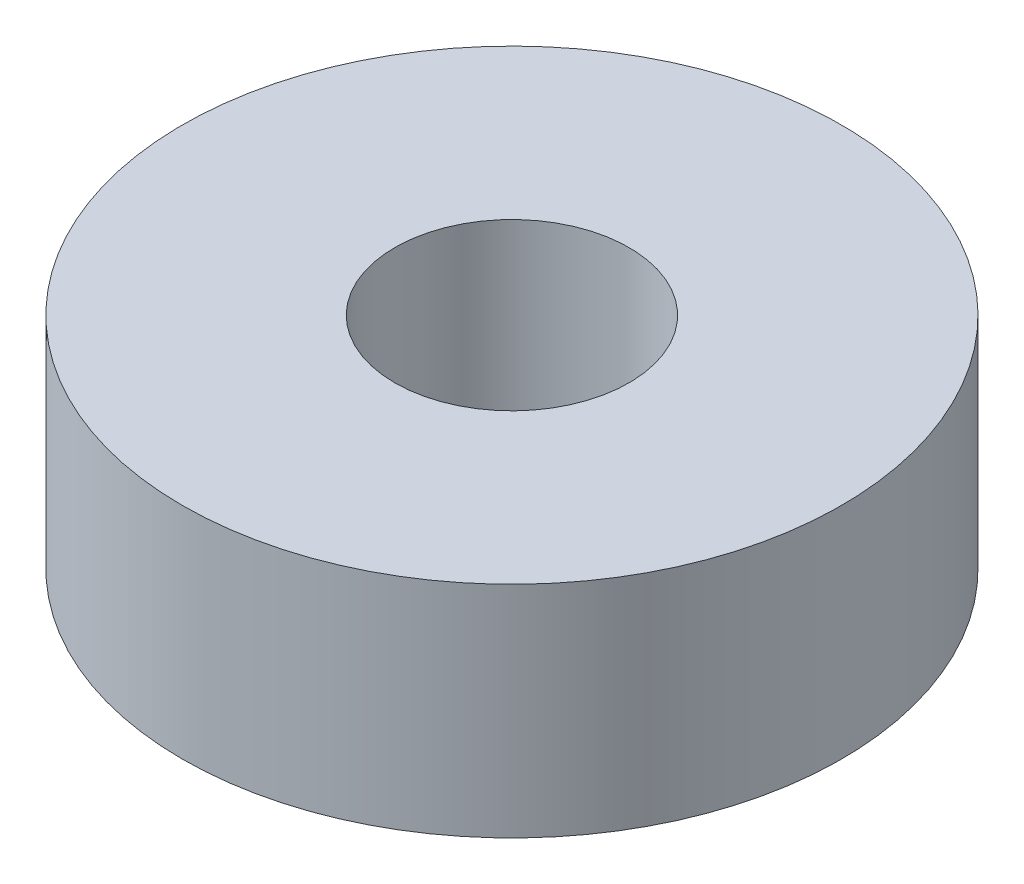
ISO-10303-21;
HEADER;
FILE_DESCRIPTION(('STEP AP214'),'2;1');
FILE_NAME('part.step','',(''),(''),'','','');
FILE_SCHEMA(('AUTOMOTIVE_DESIGN { 1 0 10303 214 1 1 1 1 }'));
ENDSEC;
DATA;
#1=APPLICATION_CONTEXT('core data for automotive mechanical design processes');
#2=APPLICATION_PROTOCOL_DEFINITION('international standard','automotive_design',2000,#1);
#3=PRODUCT_CONTEXT('',#1,'mechanical');
#4=PRODUCT('Part','Part','',(#3));
#5=PRODUCT_RELATED_PRODUCT_CATEGORY('part','',(#4));
#6=PRODUCT_DEFINITION_FORMATION('','',#4);
#7=PRODUCT_DEFINITION_CONTEXT('part definition',#1,'design');
#8=PRODUCT_DEFINITION('design','',#6,#7);
#9=PRODUCT_DEFINITION_SHAPE('','',#8);
#10=(LENGTH_UNIT() NAMED_UNIT(*) SI_UNIT(.MILLI.,.METRE.));
#11=(NAMED_UNIT(*) PLANE_ANGLE_UNIT() SI_UNIT($,.RADIAN.));
#12=(NAMED_UNIT(*) SI_UNIT($,.STERADIAN.) SOLID_ANGLE_UNIT());
#13=UNCERTAINTY_MEASURE_WITH_UNIT(LENGTH_MEASURE(1.E-05),#10,'distance_accuracy_value','');
#14=(GEOMETRIC_REPRESENTATION_CONTEXT(3) GLOBAL_UNCERTAINTY_ASSIGNED_CONTEXT((#13)) GLOBAL_UNIT_ASSIGNED_CONTEXT((#10,
#11,#12)) REPRESENTATION_CONTEXT('',''));
#15=CARTESIAN_POINT('',(0.,0.,0.));
#16=DIRECTION('',(0.,0.,1.));
#17=DIRECTION('',(1.,0.,0.));
#18=AXIS2_PLACEMENT_3D('',#15,#16,#17);
#19=CARTESIAN_POINT('',(0.,15.,0.));
#20=DIRECTION('',(0.,1.,0.));
#21=DIRECTION('',(0.,0.,1.));
#22=AXIS2_PLACEMENT_3D('',#19,#20,#21);
#23=PLANE('',#22);
#24=CARTESIAN_POINT('',(0.,15.,0.));
#25=DIRECTION('',(0.,1.,0.));
#26=DIRECTION('',(0.,0.,1.));
#27=AXIS2_PLACEMENT_3D('',#24,#25,#26);
#28=CIRCLE('',#27,22.5);
#29=CARTESIAN_POINT('',(0.,15.,22.5));
#30=VERTEX_POINT('',#29);
#31=EDGE_CURVE('E10',#30,#30,#28,.T.);
#32=ORIENTED_EDGE('',*,*,#31,.T.);
#33=EDGE_LOOP('',(#32));
#34=FACE_BOUND('',#33,.T.);
#35=CARTESIAN_POINT('',(0.,15.,0.));
#36=DIRECTION('',(0.,1.,0.));
#37=DIRECTION('',(0.,0.,1.));
#38=AXIS2_PLACEMENT_3D('',#35,#36,#37);
#39=CIRCLE('',#38,8.);
#40=CARTESIAN_POINT('',(0.,15.,8.));
#41=VERTEX_POINT('',#40);
#42=EDGE_CURVE('E44',#41,#41,#39,.T.);
#43=ORIENTED_EDGE('',*,*,#42,.F.);
#44=EDGE_LOOP('',(#43));
#45=FACE_BOUND('',#44,.T.);
#46=ADVANCED_FACE('F33',(#34,#45),#23,.T.);
#47=CARTESIAN_POINT('',(0.,0.,0.));
#48=DIRECTION('',(0.,1.,0.));
#49=DIRECTION('',(0.,0.,1.));
#50=AXIS2_PLACEMENT_3D('',#47,#48,#49);
#51=PLANE('',#50);
#52=CARTESIAN_POINT('',(0.,0.,0.));
#53=DIRECTION('',(0.,1.,0.));
#54=DIRECTION('',(0.,0.,1.));
#55=AXIS2_PLACEMENT_3D('',#52,#53,#54);
#56=CIRCLE('',#55,22.5);
#57=CARTESIAN_POINT('',(0.,0.,22.5));
#58=VERTEX_POINT('',#57);
#59=EDGE_CURVE('E37',#58,#58,#56,.T.);
#60=ORIENTED_EDGE('',*,*,#59,.F.);
#61=EDGE_LOOP('',(#60));
#62=FACE_BOUND('',#61,.T.);
#63=CARTESIAN_POINT('',(0.,0.,0.));
#64=DIRECTION('',(0.,1.,0.));
#65=DIRECTION('',(0.,0.,1.));
#66=AXIS2_PLACEMENT_3D('',#63,#64,#65);
#67=CIRCLE('',#66,8.);
#68=CARTESIAN_POINT('',(0.,0.,8.));
#69=VERTEX_POINT('',#68);
#70=EDGE_CURVE('E46',#69,#69,#67,.T.);
#71=ORIENTED_EDGE('',*,*,#70,.T.);
#72=EDGE_LOOP('',(#71));
#73=FACE_BOUND('',#72,.T.);
#74=ADVANCED_FACE('F56',(#62,#73),#51,.F.);
#75=CARTESIAN_POINT('',(0.,15.,0.));
#76=DIRECTION('',(0.,-1.,0.));
#77=DIRECTION('',(0.,0.,-1.));
#78=AXIS2_PLACEMENT_3D('',#75,#76,#77);
#79=CYLINDRICAL_SURFACE('',#78,22.5);
#80=ORIENTED_EDGE('',*,*,#31,.F.);
#81=EDGE_LOOP('',(#80));
#82=FACE_BOUND('',#81,.T.);
#83=ORIENTED_EDGE('',*,*,#59,.T.);
#84=EDGE_LOOP('',(#83));
#85=FACE_BOUND('',#84,.T.);
#86=ADVANCED_FACE('F35',(#82,#85),#79,.T.);
#87=CARTESIAN_POINT('',(0.,15.,0.));
#88=DIRECTION('',(0.,-1.,0.));
#89=DIRECTION('',(0.,0.,-1.));
#90=AXIS2_PLACEMENT_3D('',#87,#88,#89);
#91=CYLINDRICAL_SURFACE('',#90,8.);
#92=ORIENTED_EDGE('',*,*,#42,.T.);
#93=EDGE_LOOP('',(#92));
#94=FACE_BOUND('',#93,.T.);
#95=ORIENTED_EDGE('',*,*,#70,.F.);
#96=EDGE_LOOP('',(#95));
#97=FACE_BOUND('',#96,.T.);
#98=ADVANCED_FACE('F52',(#94,#97),#91,.F.);
#99=CLOSED_SHELL('',(#46,#74,#86,#98));
#100=MANIFOLD_SOLID_BREP('B2',#99);
#101=ADVANCED_BREP_SHAPE_REPRESENTATION('',(#18,#100),#14);
#102=SHAPE_DEFINITION_REPRESENTATION(#9,#101);
ENDSEC;
END-ISO-10303-21;
